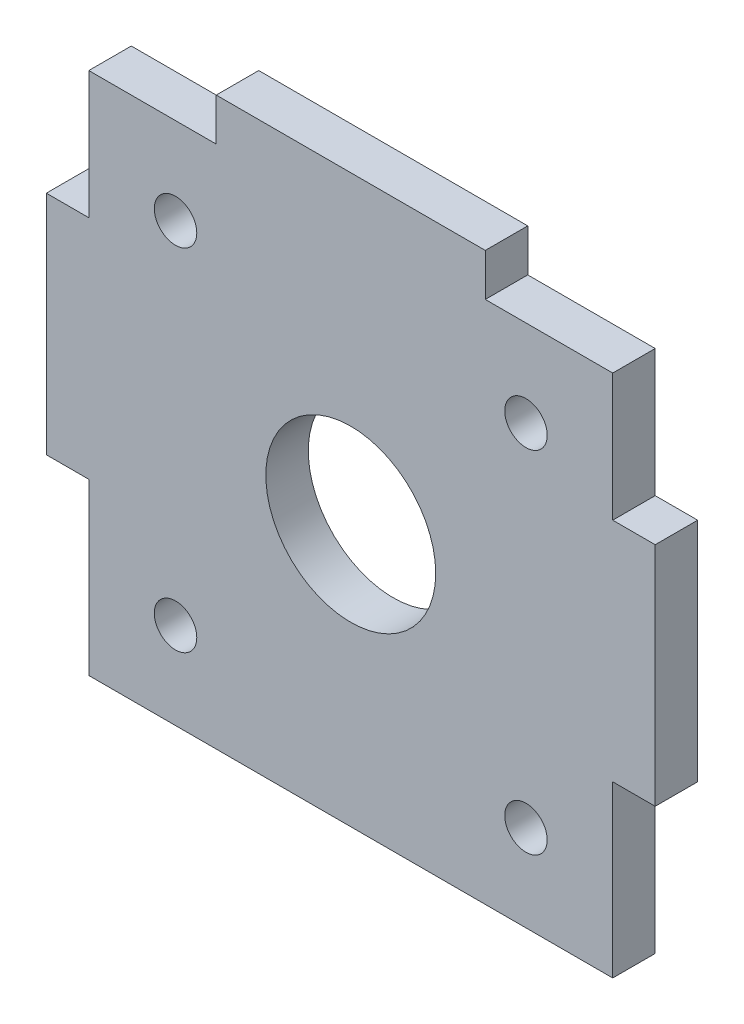
ISO-10303-21;
HEADER;
FILE_DESCRIPTION(('STEP AP214'),'2;1');
FILE_NAME('part.step','',(''),(''),'','','');
FILE_SCHEMA(('AUTOMOTIVE_DESIGN { 1 0 10303 214 1 1 1 1 }'));
ENDSEC;
DATA;
#1=APPLICATION_CONTEXT('core data for automotive mechanical design processes');
#2=APPLICATION_PROTOCOL_DEFINITION('international standard','automotive_design',2000,#1);
#3=PRODUCT_CONTEXT('',#1,'mechanical');
#4=PRODUCT('Part','Part','',(#3));
#5=PRODUCT_RELATED_PRODUCT_CATEGORY('part','',(#4));
#6=PRODUCT_DEFINITION_FORMATION('','',#4);
#7=PRODUCT_DEFINITION_CONTEXT('part definition',#1,'design');
#8=PRODUCT_DEFINITION('design','',#6,#7);
#9=PRODUCT_DEFINITION_SHAPE('','',#8);
#10=(LENGTH_UNIT() NAMED_UNIT(*) SI_UNIT(.MILLI.,.METRE.));
#11=(NAMED_UNIT(*) PLANE_ANGLE_UNIT() SI_UNIT($,.RADIAN.));
#12=(NAMED_UNIT(*) SI_UNIT($,.STERADIAN.) SOLID_ANGLE_UNIT());
#13=UNCERTAINTY_MEASURE_WITH_UNIT(LENGTH_MEASURE(1.E-05),#10,'distance_accuracy_value','');
#14=(GEOMETRIC_REPRESENTATION_CONTEXT(3) GLOBAL_UNCERTAINTY_ASSIGNED_CONTEXT((#13)) GLOBAL_UNIT_ASSIGNED_CONTEXT((#10,
#11,#12)) REPRESENTATION_CONTEXT('',''));
#15=CARTESIAN_POINT('',(0.,0.,0.));
#16=DIRECTION('',(0.,0.,1.));
#17=DIRECTION('',(1.,0.,0.));
#18=AXIS2_PLACEMENT_3D('',#15,#16,#17);
#19=CARTESIAN_POINT('',(0.,0.,3.));
#20=DIRECTION('',(0.,0.,1.));
#21=DIRECTION('',(1.,0.,0.));
#22=AXIS2_PLACEMENT_3D('',#19,#20,#21);
#23=PLANE('',#22);
#24=DIRECTION('',(-1.,0.,0.));
#25=VECTOR('',#24,1.);
#26=CARTESIAN_POINT('',(-21.5,-6.5,3.));
#27=LINE('',#26,#25);
#28=CARTESIAN_POINT('',(-18.5,-6.5,3.));
#29=VERTEX_POINT('',#28);
#30=CARTESIAN_POINT('',(-21.5,-6.5,3.));
#31=VERTEX_POINT('',#30);
#32=EDGE_CURVE('E65',#29,#31,#27,.T.);
#33=ORIENTED_EDGE('',*,*,#32,.F.);
#34=DIRECTION('',(0.,1.,0.));
#35=VECTOR('',#34,1.);
#36=CARTESIAN_POINT('',(-18.5,-18.5,3.));
#37=LINE('',#36,#35);
#38=CARTESIAN_POINT('',(-18.5,-18.5,3.));
#39=VERTEX_POINT('',#38);
#40=EDGE_CURVE('E341',#39,#29,#37,.T.);
#41=ORIENTED_EDGE('',*,*,#40,.F.);
#42=DIRECTION('',(-1.,0.,0.));
#43=VECTOR('',#42,1.);
#44=CARTESIAN_POINT('',(-18.5,-18.5,3.));
#45=LINE('',#44,#43);
#46=CARTESIAN_POINT('',(18.5,-18.5,3.));
#47=VERTEX_POINT('',#46);
#48=EDGE_CURVE('E345',#47,#39,#45,.T.);
#49=ORIENTED_EDGE('',*,*,#48,.F.);
#50=DIRECTION('',(0.,-1.,0.));
#51=VECTOR('',#50,1.);
#52=CARTESIAN_POINT('',(18.5,-18.5,3.));
#53=LINE('',#52,#51);
#54=CARTESIAN_POINT('',(18.5,-6.5,3.));
#55=VERTEX_POINT('',#54);
#56=EDGE_CURVE('E349',#55,#47,#53,.T.);
#57=ORIENTED_EDGE('',*,*,#56,.F.);
#58=DIRECTION('',(-1.,0.,0.));
#59=VECTOR('',#58,1.);
#60=CARTESIAN_POINT('',(21.5,-6.5,3.));
#61=LINE('',#60,#59);
#62=CARTESIAN_POINT('',(21.5,-6.5,3.));
#63=VERTEX_POINT('',#62);
#64=EDGE_CURVE('E296',#63,#55,#61,.T.);
#65=ORIENTED_EDGE('',*,*,#64,.F.);
#66=DIRECTION('',(0.,1.,0.));
#67=VECTOR('',#66,1.);
#68=CARTESIAN_POINT('',(21.5,21.5,3.));
#69=LINE('',#68,#67);
#70=CARTESIAN_POINT('',(21.5,9.5,3.));
#71=VERTEX_POINT('',#70);
#72=EDGE_CURVE('E174',#63,#71,#69,.T.);
#73=ORIENTED_EDGE('',*,*,#72,.T.);
#74=DIRECTION('',(1.,0.,0.));
#75=VECTOR('',#74,1.);
#76=CARTESIAN_POINT('',(21.5,9.5,3.));
#77=LINE('',#76,#75);
#78=CARTESIAN_POINT('',(18.5,9.5,3.));
#79=VERTEX_POINT('',#78);
#80=EDGE_CURVE('E266',#79,#71,#77,.T.);
#81=ORIENTED_EDGE('',*,*,#80,.F.);
#82=DIRECTION('',(0.,-1.,0.));
#83=VECTOR('',#82,1.);
#84=CARTESIAN_POINT('',(18.5,9.5,3.));
#85=LINE('',#84,#83);
#86=CARTESIAN_POINT('',(18.5,18.5,3.));
#87=VERTEX_POINT('',#86);
#88=EDGE_CURVE('E254',#87,#79,#85,.T.);
#89=ORIENTED_EDGE('',*,*,#88,.F.);
#90=DIRECTION('',(1.,0.,0.));
#91=VECTOR('',#90,1.);
#92=CARTESIAN_POINT('',(18.5,18.5,3.));
#93=LINE('',#92,#91);
#94=CARTESIAN_POINT('',(9.49999999999999,18.5,3.));
#95=VERTEX_POINT('',#94);
#96=EDGE_CURVE('E258',#95,#87,#93,.T.);
#97=ORIENTED_EDGE('',*,*,#96,.F.);
#98=DIRECTION('',(0.,-1.,0.));
#99=VECTOR('',#98,1.);
#100=CARTESIAN_POINT('',(9.49999999999999,18.5,3.));
#101=LINE('',#100,#99);
#102=CARTESIAN_POINT('',(9.49999999999999,21.5,3.));
#103=VERTEX_POINT('',#102);
#104=EDGE_CURVE('E262',#103,#95,#101,.T.);
#105=ORIENTED_EDGE('',*,*,#104,.F.);
#106=DIRECTION('',(-1.,0.,0.));
#107=VECTOR('',#106,1.);
#108=CARTESIAN_POINT('',(-21.5,21.5,3.));
#109=LINE('',#108,#107);
#110=CARTESIAN_POINT('',(-9.5,21.5,3.));
#111=VERTEX_POINT('',#110);
#112=EDGE_CURVE('E49',#103,#111,#109,.T.);
#113=ORIENTED_EDGE('',*,*,#112,.T.);
#114=DIRECTION('',(0.,1.,0.));
#115=VECTOR('',#114,1.);
#116=CARTESIAN_POINT('',(-9.5,18.5,3.));
#117=LINE('',#116,#115);
#118=CARTESIAN_POINT('',(-9.5,18.5,3.));
#119=VERTEX_POINT('',#118);
#120=EDGE_CURVE('E297',#119,#111,#117,.T.);
#121=ORIENTED_EDGE('',*,*,#120,.F.);
#122=DIRECTION('',(1.,0.,0.));
#123=VECTOR('',#122,1.);
#124=CARTESIAN_POINT('',(-18.5,18.5,3.));
#125=LINE('',#124,#123);
#126=CARTESIAN_POINT('',(-18.5,18.5,3.));
#127=VERTEX_POINT('',#126);
#128=EDGE_CURVE('E301',#127,#119,#125,.T.);
#129=ORIENTED_EDGE('',*,*,#128,.F.);
#130=DIRECTION('',(0.,1.,0.));
#131=VECTOR('',#130,1.);
#132=CARTESIAN_POINT('',(-18.5,9.49999999999999,3.));
#133=LINE('',#132,#131);
#134=CARTESIAN_POINT('',(-18.5,9.49999999999999,3.));
#135=VERTEX_POINT('',#134);
#136=EDGE_CURVE('E305',#135,#127,#133,.T.);
#137=ORIENTED_EDGE('',*,*,#136,.F.);
#138=DIRECTION('',(1.,0.,0.));
#139=VECTOR('',#138,1.);
#140=CARTESIAN_POINT('',(-21.5,9.49999999999999,3.));
#141=LINE('',#140,#139);
#142=CARTESIAN_POINT('',(-21.5,9.49999999999999,3.));
#143=VERTEX_POINT('',#142);
#144=EDGE_CURVE('E253',#143,#135,#141,.T.);
#145=ORIENTED_EDGE('',*,*,#144,.F.);
#146=DIRECTION('',(0.,-1.,0.));
#147=VECTOR('',#146,1.);
#148=CARTESIAN_POINT('',(-21.5,21.5,3.));
#149=LINE('',#148,#147);
#150=EDGE_CURVE('E11',#143,#31,#149,.T.);
#151=ORIENTED_EDGE('',*,*,#150,.T.);
#152=EDGE_LOOP('',(#33,#41,#49,#57,#65,#73,#81,#89,#97,#105,#113,#121,#129,#137,#145,#151));
#153=FACE_BOUND('',#152,.T.);
#154=CARTESIAN_POINT('',(-12.3743686707647,-12.3743686707645,3.));
#155=DIRECTION('',(0.,0.,1.));
#156=DIRECTION('',(1.,0.,0.));
#157=AXIS2_PLACEMENT_3D('',#154,#155,#156);
#158=CIRCLE('',#157,1.5);
#159=CARTESIAN_POINT('',(-10.8743686707647,-12.3743686707645,3.));
#160=VERTEX_POINT('',#159);
#161=EDGE_CURVE('E217',#160,#160,#158,.T.);
#162=ORIENTED_EDGE('',*,*,#161,.F.);
#163=EDGE_LOOP('',(#162));
#164=FACE_BOUND('',#163,.T.);
#165=CARTESIAN_POINT('',(12.3743686707645,-12.3743686707646,3.));
#166=DIRECTION('',(0.,0.,1.));
#167=DIRECTION('',(1.,0.,0.));
#168=AXIS2_PLACEMENT_3D('',#165,#166,#167);
#169=CIRCLE('',#168,1.5);
#170=CARTESIAN_POINT('',(13.8743686707645,-12.3743686707646,3.));
#171=VERTEX_POINT('',#170);
#172=EDGE_CURVE('E203',#171,#171,#169,.T.);
#173=ORIENTED_EDGE('',*,*,#172,.F.);
#174=EDGE_LOOP('',(#173));
#175=FACE_BOUND('',#174,.T.);
#176=CARTESIAN_POINT('',(-12.3743686707645,12.3743686707647,3.));
#177=DIRECTION('',(0.,0.,1.));
#178=DIRECTION('',(1.,0.,0.));
#179=AXIS2_PLACEMENT_3D('',#176,#177,#178);
#180=CIRCLE('',#179,1.5);
#181=CARTESIAN_POINT('',(-10.8743686707645,12.3743686707647,3.));
#182=VERTEX_POINT('',#181);
#183=EDGE_CURVE('E187',#182,#182,#180,.T.);
#184=ORIENTED_EDGE('',*,*,#183,.F.);
#185=EDGE_LOOP('',(#184));
#186=FACE_BOUND('',#185,.T.);
#187=CARTESIAN_POINT('',(12.3743686707646,12.3743686707645,3.));
#188=DIRECTION('',(0.,0.,1.));
#189=DIRECTION('',(1.,0.,0.));
#190=AXIS2_PLACEMENT_3D('',#187,#188,#189);
#191=CIRCLE('',#190,1.5);
#192=CARTESIAN_POINT('',(13.8743686707646,12.3743686707645,3.));
#193=VERTEX_POINT('',#192);
#194=EDGE_CURVE('E209',#193,#193,#191,.T.);
#195=ORIENTED_EDGE('',*,*,#194,.F.);
#196=EDGE_LOOP('',(#195));
#197=FACE_BOUND('',#196,.T.);
#198=CARTESIAN_POINT('',(0.,0.,3.));
#199=DIRECTION('',(0.,0.,1.));
#200=DIRECTION('',(1.,0.,0.));
#201=AXIS2_PLACEMENT_3D('',#198,#199,#200);
#202=CIRCLE('',#201,6.);
#203=CARTESIAN_POINT('',(5.99999999999999,0.,3.));
#204=VERTEX_POINT('',#203);
#205=EDGE_CURVE('E225',#204,#204,#202,.T.);
#206=ORIENTED_EDGE('',*,*,#205,.F.);
#207=EDGE_LOOP('',(#206));
#208=FACE_BOUND('',#207,.T.);
#209=ADVANCED_FACE('F39',(#153,#164,#175,#186,#197,#208),#23,.T.);
#210=CARTESIAN_POINT('',(0.,0.,0.));
#211=DIRECTION('',(0.,0.,1.));
#212=DIRECTION('',(1.,0.,0.));
#213=AXIS2_PLACEMENT_3D('',#210,#211,#212);
#214=PLANE('',#213);
#215=DIRECTION('',(0.,1.,0.));
#216=VECTOR('',#215,1.);
#217=CARTESIAN_POINT('',(-18.5,-18.5,0.));
#218=LINE('',#217,#216);
#219=CARTESIAN_POINT('',(-18.5,-18.5,0.));
#220=VERTEX_POINT('',#219);
#221=CARTESIAN_POINT('',(-18.5,-6.5,0.));
#222=VERTEX_POINT('',#221);
#223=EDGE_CURVE('E358',#220,#222,#218,.T.);
#224=ORIENTED_EDGE('',*,*,#223,.T.);
#225=DIRECTION('',(-1.,0.,0.));
#226=VECTOR('',#225,1.);
#227=CARTESIAN_POINT('',(-21.5,-6.5,0.));
#228=LINE('',#227,#226);
#229=CARTESIAN_POINT('',(-21.5,-6.5,0.));
#230=VERTEX_POINT('',#229);
#231=EDGE_CURVE('E176',#222,#230,#228,.T.);
#232=ORIENTED_EDGE('',*,*,#231,.T.);
#233=DIRECTION('',(0.,-1.,0.));
#234=VECTOR('',#233,1.);
#235=CARTESIAN_POINT('',(-21.5,21.5,0.));
#236=LINE('',#235,#234);
#237=CARTESIAN_POINT('',(-21.5,9.49999999999999,0.));
#238=VERTEX_POINT('',#237);
#239=EDGE_CURVE('E43',#238,#230,#236,.T.);
#240=ORIENTED_EDGE('',*,*,#239,.F.);
#241=DIRECTION('',(1.,0.,0.));
#242=VECTOR('',#241,1.);
#243=CARTESIAN_POINT('',(-21.5,9.49999999999999,0.));
#244=LINE('',#243,#242);
#245=CARTESIAN_POINT('',(-18.5,9.49999999999999,0.));
#246=VERTEX_POINT('',#245);
#247=EDGE_CURVE('E300',#238,#246,#244,.T.);
#248=ORIENTED_EDGE('',*,*,#247,.T.);
#249=DIRECTION('',(0.,1.,0.));
#250=VECTOR('',#249,1.);
#251=CARTESIAN_POINT('',(-18.5,9.49999999999999,0.));
#252=LINE('',#251,#250);
#253=CARTESIAN_POINT('',(-18.5,18.5,0.));
#254=VERTEX_POINT('',#253);
#255=EDGE_CURVE('E319',#246,#254,#252,.T.);
#256=ORIENTED_EDGE('',*,*,#255,.T.);
#257=DIRECTION('',(1.,0.,0.));
#258=VECTOR('',#257,1.);
#259=CARTESIAN_POINT('',(-18.5,18.5,0.));
#260=LINE('',#259,#258);
#261=CARTESIAN_POINT('',(-9.5,18.5,0.));
#262=VERTEX_POINT('',#261);
#263=EDGE_CURVE('E315',#254,#262,#260,.T.);
#264=ORIENTED_EDGE('',*,*,#263,.T.);
#265=DIRECTION('',(0.,1.,0.));
#266=VECTOR('',#265,1.);
#267=CARTESIAN_POINT('',(-9.5,18.5,0.));
#268=LINE('',#267,#266);
#269=CARTESIAN_POINT('',(-9.5,21.5,0.));
#270=VERTEX_POINT('',#269);
#271=EDGE_CURVE('E283',#262,#270,#268,.T.);
#272=ORIENTED_EDGE('',*,*,#271,.T.);
#273=DIRECTION('',(-1.,0.,0.));
#274=VECTOR('',#273,1.);
#275=CARTESIAN_POINT('',(-21.5,21.5,0.));
#276=LINE('',#275,#274);
#277=CARTESIAN_POINT('',(9.49999999999999,21.5,0.));
#278=VERTEX_POINT('',#277);
#279=EDGE_CURVE('E186',#278,#270,#276,.T.);
#280=ORIENTED_EDGE('',*,*,#279,.F.);
#281=DIRECTION('',(0.,-1.,0.));
#282=VECTOR('',#281,1.);
#283=CARTESIAN_POINT('',(9.49999999999999,18.5,0.));
#284=LINE('',#283,#282);
#285=CARTESIAN_POINT('',(9.49999999999999,18.5,0.));
#286=VERTEX_POINT('',#285);
#287=EDGE_CURVE('E57',#278,#286,#284,.T.);
#288=ORIENTED_EDGE('',*,*,#287,.T.);
#289=DIRECTION('',(1.,0.,0.));
#290=VECTOR('',#289,1.);
#291=CARTESIAN_POINT('',(18.5,18.5,0.));
#292=LINE('',#291,#290);
#293=CARTESIAN_POINT('',(18.5,18.5,0.));
#294=VERTEX_POINT('',#293);
#295=EDGE_CURVE('E271',#286,#294,#292,.T.);
#296=ORIENTED_EDGE('',*,*,#295,.T.);
#297=DIRECTION('',(0.,-1.,0.));
#298=VECTOR('',#297,1.);
#299=CARTESIAN_POINT('',(18.5,9.5,0.));
#300=LINE('',#299,#298);
#301=CARTESIAN_POINT('',(18.5,9.5,0.));
#302=VERTEX_POINT('',#301);
#303=EDGE_CURVE('E241',#294,#302,#300,.T.);
#304=ORIENTED_EDGE('',*,*,#303,.T.);
#305=DIRECTION('',(1.,0.,0.));
#306=VECTOR('',#305,1.);
#307=CARTESIAN_POINT('',(21.5,9.5,0.));
#308=LINE('',#307,#306);
#309=CARTESIAN_POINT('',(21.5,9.5,0.));
#310=VERTEX_POINT('',#309);
#311=EDGE_CURVE('E184',#302,#310,#308,.T.);
#312=ORIENTED_EDGE('',*,*,#311,.T.);
#313=DIRECTION('',(0.,1.,0.));
#314=VECTOR('',#313,1.);
#315=CARTESIAN_POINT('',(21.5,21.5,0.));
#316=LINE('',#315,#314);
#317=CARTESIAN_POINT('',(21.5,-6.5,0.));
#318=VERTEX_POINT('',#317);
#319=EDGE_CURVE('E172',#318,#310,#316,.T.);
#320=ORIENTED_EDGE('',*,*,#319,.F.);
#321=DIRECTION('',(-1.,0.,0.));
#322=VECTOR('',#321,1.);
#323=CARTESIAN_POINT('',(21.5,-6.5,0.));
#324=LINE('',#323,#322);
#325=CARTESIAN_POINT('',(18.5,-6.5,0.));
#326=VERTEX_POINT('',#325);
#327=EDGE_CURVE('E154',#318,#326,#324,.T.);
#328=ORIENTED_EDGE('',*,*,#327,.T.);
#329=DIRECTION('',(0.,-1.,0.));
#330=VECTOR('',#329,1.);
#331=CARTESIAN_POINT('',(18.5,-18.5,0.));
#332=LINE('',#331,#330);
#333=CARTESIAN_POINT('',(18.5,-18.5,0.));
#334=VERTEX_POINT('',#333);
#335=EDGE_CURVE('E166',#326,#334,#332,.T.);
#336=ORIENTED_EDGE('',*,*,#335,.T.);
#337=DIRECTION('',(-1.,0.,0.));
#338=VECTOR('',#337,1.);
#339=CARTESIAN_POINT('',(-18.5,-18.5,0.));
#340=LINE('',#339,#338);
#341=EDGE_CURVE('E361',#334,#220,#340,.T.);
#342=ORIENTED_EDGE('',*,*,#341,.T.);
#343=EDGE_LOOP('',(#224,#232,#240,#248,#256,#264,#272,#280,#288,#296,#304,#312,#320,#328,#336,#342));
#344=FACE_BOUND('',#343,.T.);
#345=CARTESIAN_POINT('',(-12.3743686707645,12.3743686707647,0.));
#346=DIRECTION('',(0.,0.,1.));
#347=DIRECTION('',(1.,0.,0.));
#348=AXIS2_PLACEMENT_3D('',#345,#346,#347);
#349=CIRCLE('',#348,1.5);
#350=CARTESIAN_POINT('',(-10.8743686707645,12.3743686707647,0.));
#351=VERTEX_POINT('',#350);
#352=EDGE_CURVE('E193',#351,#351,#349,.T.);
#353=ORIENTED_EDGE('',*,*,#352,.T.);
#354=EDGE_LOOP('',(#353));
#355=FACE_BOUND('',#354,.T.);
#356=CARTESIAN_POINT('',(12.3743686707645,-12.3743686707646,0.));
#357=DIRECTION('',(0.,0.,1.));
#358=DIRECTION('',(1.,0.,0.));
#359=AXIS2_PLACEMENT_3D('',#356,#357,#358);
#360=CIRCLE('',#359,1.5);
#361=CARTESIAN_POINT('',(13.8743686707645,-12.3743686707646,0.));
#362=VERTEX_POINT('',#361);
#363=EDGE_CURVE('E205',#362,#362,#360,.T.);
#364=ORIENTED_EDGE('',*,*,#363,.T.);
#365=EDGE_LOOP('',(#364));
#366=FACE_BOUND('',#365,.T.);
#367=CARTESIAN_POINT('',(12.3743686707646,12.3743686707645,0.));
#368=DIRECTION('',(0.,0.,1.));
#369=DIRECTION('',(1.,0.,0.));
#370=AXIS2_PLACEMENT_3D('',#367,#368,#369);
#371=CIRCLE('',#370,1.5);
#372=CARTESIAN_POINT('',(13.8743686707646,12.3743686707645,0.));
#373=VERTEX_POINT('',#372);
#374=EDGE_CURVE('E213',#373,#373,#371,.T.);
#375=ORIENTED_EDGE('',*,*,#374,.T.);
#376=EDGE_LOOP('',(#375));
#377=FACE_BOUND('',#376,.T.);
#378=CARTESIAN_POINT('',(-12.3743686707647,-12.3743686707645,0.));
#379=DIRECTION('',(0.,0.,1.));
#380=DIRECTION('',(1.,0.,0.));
#381=AXIS2_PLACEMENT_3D('',#378,#379,#380);
#382=CIRCLE('',#381,1.5);
#383=CARTESIAN_POINT('',(-10.8743686707647,-12.3743686707645,0.));
#384=VERTEX_POINT('',#383);
#385=EDGE_CURVE('E221',#384,#384,#382,.T.);
#386=ORIENTED_EDGE('',*,*,#385,.T.);
#387=EDGE_LOOP('',(#386));
#388=FACE_BOUND('',#387,.T.);
#389=CARTESIAN_POINT('',(0.,0.,0.));
#390=DIRECTION('',(0.,0.,1.));
#391=DIRECTION('',(1.,0.,0.));
#392=AXIS2_PLACEMENT_3D('',#389,#390,#391);
#393=CIRCLE('',#392,6.);
#394=CARTESIAN_POINT('',(5.99999999999999,0.,0.));
#395=VERTEX_POINT('',#394);
#396=EDGE_CURVE('E229',#395,#395,#393,.T.);
#397=ORIENTED_EDGE('',*,*,#396,.T.);
#398=EDGE_LOOP('',(#397));
#399=FACE_BOUND('',#398,.T.);
#400=ADVANCED_FACE('F180',(#344,#355,#366,#377,#388,#399),#214,.F.);
#401=CARTESIAN_POINT('',(21.5,21.5,3.));
#402=DIRECTION('',(-1.,0.,0.));
#403=DIRECTION('',(0.,-1.,0.));
#404=AXIS2_PLACEMENT_3D('',#401,#402,#403);
#405=PLANE('',#404);
#406=ORIENTED_EDGE('',*,*,#72,.F.);
#407=DIRECTION('',(0.,0.,1.));
#408=VECTOR('',#407,1.);
#409=CARTESIAN_POINT('',(21.5,-6.5,0.));
#410=LINE('',#409,#408);
#411=EDGE_CURVE('E158',#318,#63,#410,.T.);
#412=ORIENTED_EDGE('',*,*,#411,.F.);
#413=ORIENTED_EDGE('',*,*,#319,.T.);
#414=DIRECTION('',(0.,0.,1.));
#415=VECTOR('',#414,1.);
#416=CARTESIAN_POINT('',(21.5,9.5,0.));
#417=LINE('',#416,#415);
#418=EDGE_CURVE('E237',#310,#71,#417,.T.);
#419=ORIENTED_EDGE('',*,*,#418,.T.);
#420=EDGE_LOOP('',(#406,#412,#413,#419));
#421=FACE_BOUND('',#420,.T.);
#422=ADVANCED_FACE('F41',(#421),#405,.F.);
#423=CARTESIAN_POINT('',(-21.5,21.5,3.));
#424=DIRECTION('',(0.,-1.,0.));
#425=DIRECTION('',(1.,0.,0.));
#426=AXIS2_PLACEMENT_3D('',#423,#424,#425);
#427=PLANE('',#426);
#428=ORIENTED_EDGE('',*,*,#279,.T.);
#429=DIRECTION('',(0.,0.,1.));
#430=VECTOR('',#429,1.);
#431=CARTESIAN_POINT('',(-9.5,21.5,0.));
#432=LINE('',#431,#430);
#433=EDGE_CURVE('E292',#270,#111,#432,.T.);
#434=ORIENTED_EDGE('',*,*,#433,.T.);
#435=ORIENTED_EDGE('',*,*,#112,.F.);
#436=DIRECTION('',(0.,0.,1.));
#437=VECTOR('',#436,1.);
#438=CARTESIAN_POINT('',(9.49999999999999,21.5,0.));
#439=LINE('',#438,#437);
#440=EDGE_CURVE('E240',#278,#103,#439,.T.);
#441=ORIENTED_EDGE('',*,*,#440,.F.);
#442=EDGE_LOOP('',(#428,#434,#435,#441));
#443=FACE_BOUND('',#442,.T.);
#444=ADVANCED_FACE('F405',(#443),#427,.F.);
#445=CARTESIAN_POINT('',(-21.5,21.5,3.));
#446=DIRECTION('',(1.,0.,0.));
#447=DIRECTION('',(0.,1.,0.));
#448=AXIS2_PLACEMENT_3D('',#445,#446,#447);
#449=PLANE('',#448);
#450=ORIENTED_EDGE('',*,*,#239,.T.);
#451=DIRECTION('',(0.,0.,1.));
#452=VECTOR('',#451,1.);
#453=CARTESIAN_POINT('',(-21.5,-6.5,0.));
#454=LINE('',#453,#452);
#455=EDGE_CURVE('E233',#230,#31,#454,.T.);
#456=ORIENTED_EDGE('',*,*,#455,.T.);
#457=ORIENTED_EDGE('',*,*,#150,.F.);
#458=DIRECTION('',(0.,0.,1.));
#459=VECTOR('',#458,1.);
#460=CARTESIAN_POINT('',(-21.5,9.49999999999999,0.));
#461=LINE('',#460,#459);
#462=EDGE_CURVE('E279',#238,#143,#461,.T.);
#463=ORIENTED_EDGE('',*,*,#462,.F.);
#464=EDGE_LOOP('',(#450,#456,#457,#463));
#465=FACE_BOUND('',#464,.T.);
#466=ADVANCED_FACE('F382',(#465),#449,.F.);
#467=CARTESIAN_POINT('',(-12.3743686707645,12.3743686707647,3.));
#468=DIRECTION('',(0.,0.,-1.));
#469=DIRECTION('',(-1.,0.,0.));
#470=AXIS2_PLACEMENT_3D('',#467,#468,#469);
#471=CYLINDRICAL_SURFACE('',#470,1.5);
#472=ORIENTED_EDGE('',*,*,#183,.T.);
#473=EDGE_LOOP('',(#472));
#474=FACE_BOUND('',#473,.T.);
#475=ORIENTED_EDGE('',*,*,#352,.F.);
#476=EDGE_LOOP('',(#475));
#477=FACE_BOUND('',#476,.T.);
#478=ADVANCED_FACE('F436',(#474,#477),#471,.F.);
#479=CARTESIAN_POINT('',(12.3743686707645,-12.3743686707646,3.));
#480=DIRECTION('',(0.,0.,-1.));
#481=DIRECTION('',(-1.,0.,0.));
#482=AXIS2_PLACEMENT_3D('',#479,#480,#481);
#483=CYLINDRICAL_SURFACE('',#482,1.5);
#484=ORIENTED_EDGE('',*,*,#172,.T.);
#485=EDGE_LOOP('',(#484));
#486=FACE_BOUND('',#485,.T.);
#487=ORIENTED_EDGE('',*,*,#363,.F.);
#488=EDGE_LOOP('',(#487));
#489=FACE_BOUND('',#488,.T.);
#490=ADVANCED_FACE('F485',(#486,#489),#483,.F.);
#491=CARTESIAN_POINT('',(12.3743686707646,12.3743686707645,3.));
#492=DIRECTION('',(0.,0.,-1.));
#493=DIRECTION('',(-1.,0.,0.));
#494=AXIS2_PLACEMENT_3D('',#491,#492,#493);
#495=CYLINDRICAL_SURFACE('',#494,1.5);
#496=ORIENTED_EDGE('',*,*,#194,.T.);
#497=EDGE_LOOP('',(#496));
#498=FACE_BOUND('',#497,.T.);
#499=ORIENTED_EDGE('',*,*,#374,.F.);
#500=EDGE_LOOP('',(#499));
#501=FACE_BOUND('',#500,.T.);
#502=ADVANCED_FACE('F475',(#498,#501),#495,.F.);
#503=CARTESIAN_POINT('',(-12.3743686707647,-12.3743686707645,3.));
#504=DIRECTION('',(0.,0.,-1.));
#505=DIRECTION('',(-1.,0.,0.));
#506=AXIS2_PLACEMENT_3D('',#503,#504,#505);
#507=CYLINDRICAL_SURFACE('',#506,1.5);
#508=ORIENTED_EDGE('',*,*,#161,.T.);
#509=EDGE_LOOP('',(#508));
#510=FACE_BOUND('',#509,.T.);
#511=ORIENTED_EDGE('',*,*,#385,.F.);
#512=EDGE_LOOP('',(#511));
#513=FACE_BOUND('',#512,.T.);
#514=ADVANCED_FACE('F464',(#510,#513),#507,.F.);
#515=CARTESIAN_POINT('',(0.,0.,3.));
#516=DIRECTION('',(0.,0.,-1.));
#517=DIRECTION('',(-1.,0.,0.));
#518=AXIS2_PLACEMENT_3D('',#515,#516,#517);
#519=CYLINDRICAL_SURFACE('',#518,6.);
#520=ORIENTED_EDGE('',*,*,#205,.T.);
#521=EDGE_LOOP('',(#520));
#522=FACE_BOUND('',#521,.T.);
#523=ORIENTED_EDGE('',*,*,#396,.F.);
#524=EDGE_LOOP('',(#523));
#525=FACE_BOUND('',#524,.T.);
#526=ADVANCED_FACE('F459',(#522,#525),#519,.F.);
#527=CARTESIAN_POINT('',(-9.5,18.5,0.));
#528=DIRECTION('',(1.,0.,0.));
#529=DIRECTION('',(0.,0.,-1.));
#530=AXIS2_PLACEMENT_3D('',#527,#528,#529);
#531=PLANE('',#530);
#532=ORIENTED_EDGE('',*,*,#120,.T.);
#533=ORIENTED_EDGE('',*,*,#433,.F.);
#534=ORIENTED_EDGE('',*,*,#271,.F.);
#535=DIRECTION('',(0.,0.,1.));
#536=VECTOR('',#535,1.);
#537=CARTESIAN_POINT('',(-9.5,18.5,0.));
#538=LINE('',#537,#536);
#539=EDGE_CURVE('E289',#262,#119,#538,.T.);
#540=ORIENTED_EDGE('',*,*,#539,.T.);
#541=EDGE_LOOP('',(#532,#533,#534,#540));
#542=FACE_BOUND('',#541,.T.);
#543=ADVANCED_FACE('F402',(#542),#531,.F.);
#544=CARTESIAN_POINT('',(-18.5,18.5,0.));
#545=DIRECTION('',(0.,-1.,0.));
#546=DIRECTION('',(0.,0.,-1.));
#547=AXIS2_PLACEMENT_3D('',#544,#545,#546);
#548=PLANE('',#547);
#549=ORIENTED_EDGE('',*,*,#128,.T.);
#550=ORIENTED_EDGE('',*,*,#539,.F.);
#551=ORIENTED_EDGE('',*,*,#263,.F.);
#552=DIRECTION('',(0.,0.,1.));
#553=VECTOR('',#552,1.);
#554=CARTESIAN_POINT('',(-18.5,18.5,0.));
#555=LINE('',#554,#553);
#556=EDGE_CURVE('E286',#254,#127,#555,.T.);
#557=ORIENTED_EDGE('',*,*,#556,.T.);
#558=EDGE_LOOP('',(#549,#550,#551,#557));
#559=FACE_BOUND('',#558,.T.);
#560=ADVANCED_FACE('F400',(#559),#548,.F.);
#561=CARTESIAN_POINT('',(-18.5,9.49999999999999,0.));
#562=DIRECTION('',(1.,0.,0.));
#563=DIRECTION('',(0.,0.,-1.));
#564=AXIS2_PLACEMENT_3D('',#561,#562,#563);
#565=PLANE('',#564);
#566=ORIENTED_EDGE('',*,*,#136,.T.);
#567=ORIENTED_EDGE('',*,*,#556,.F.);
#568=ORIENTED_EDGE('',*,*,#255,.F.);
#569=DIRECTION('',(0.,0.,1.));
#570=VECTOR('',#569,1.);
#571=CARTESIAN_POINT('',(-18.5,9.49999999999999,0.));
#572=LINE('',#571,#570);
#573=EDGE_CURVE('E282',#246,#135,#572,.T.);
#574=ORIENTED_EDGE('',*,*,#573,.T.);
#575=EDGE_LOOP('',(#566,#567,#568,#574));
#576=FACE_BOUND('',#575,.T.);
#577=ADVANCED_FACE('F394',(#576),#565,.F.);
#578=CARTESIAN_POINT('',(-21.5,9.49999999999999,0.));
#579=DIRECTION('',(0.,-1.,0.));
#580=DIRECTION('',(0.,0.,-1.));
#581=AXIS2_PLACEMENT_3D('',#578,#579,#580);
#582=PLANE('',#581);
#583=ORIENTED_EDGE('',*,*,#144,.T.);
#584=ORIENTED_EDGE('',*,*,#573,.F.);
#585=ORIENTED_EDGE('',*,*,#247,.F.);
#586=ORIENTED_EDGE('',*,*,#462,.T.);
#587=EDGE_LOOP('',(#583,#584,#585,#586));
#588=FACE_BOUND('',#587,.T.);
#589=ADVANCED_FACE('F387',(#588),#582,.F.);
#590=CARTESIAN_POINT('',(-21.5,-6.5,0.));
#591=DIRECTION('',(0.,1.,0.));
#592=DIRECTION('',(0.,0.,1.));
#593=AXIS2_PLACEMENT_3D('',#590,#591,#592);
#594=PLANE('',#593);
#595=ORIENTED_EDGE('',*,*,#32,.T.);
#596=ORIENTED_EDGE('',*,*,#455,.F.);
#597=ORIENTED_EDGE('',*,*,#231,.F.);
#598=DIRECTION('',(0.,0.,1.));
#599=VECTOR('',#598,1.);
#600=CARTESIAN_POINT('',(-18.5,-6.5,0.));
#601=LINE('',#600,#599);
#602=EDGE_CURVE('E334',#222,#29,#601,.T.);
#603=ORIENTED_EDGE('',*,*,#602,.T.);
#604=EDGE_LOOP('',(#595,#596,#597,#603));
#605=FACE_BOUND('',#604,.T.);
#606=ADVANCED_FACE('F541',(#605),#594,.F.);
#607=CARTESIAN_POINT('',(-18.5,-18.5,0.));
#608=DIRECTION('',(1.,0.,0.));
#609=DIRECTION('',(0.,0.,-1.));
#610=AXIS2_PLACEMENT_3D('',#607,#608,#609);
#611=PLANE('',#610);
#612=ORIENTED_EDGE('',*,*,#40,.T.);
#613=ORIENTED_EDGE('',*,*,#602,.F.);
#614=ORIENTED_EDGE('',*,*,#223,.F.);
#615=DIRECTION('',(0.,0.,1.));
#616=VECTOR('',#615,1.);
#617=CARTESIAN_POINT('',(-18.5,-18.5,0.));
#618=LINE('',#617,#616);
#619=EDGE_CURVE('E331',#220,#39,#618,.T.);
#620=ORIENTED_EDGE('',*,*,#619,.T.);
#621=EDGE_LOOP('',(#612,#613,#614,#620));
#622=FACE_BOUND('',#621,.T.);
#623=ADVANCED_FACE('F376',(#622),#611,.F.);
#624=CARTESIAN_POINT('',(-18.5,-18.5,0.));
#625=DIRECTION('',(0.,1.,0.));
#626=DIRECTION('',(0.,0.,1.));
#627=AXIS2_PLACEMENT_3D('',#624,#625,#626);
#628=PLANE('',#627);
#629=ORIENTED_EDGE('',*,*,#48,.T.);
#630=ORIENTED_EDGE('',*,*,#619,.F.);
#631=ORIENTED_EDGE('',*,*,#341,.F.);
#632=DIRECTION('',(0.,0.,1.));
#633=VECTOR('',#632,1.);
#634=CARTESIAN_POINT('',(18.5,-18.5,0.));
#635=LINE('',#634,#633);
#636=EDGE_CURVE('E328',#334,#47,#635,.T.);
#637=ORIENTED_EDGE('',*,*,#636,.T.);
#638=EDGE_LOOP('',(#629,#630,#631,#637));
#639=FACE_BOUND('',#638,.T.);
#640=ADVANCED_FACE('F372',(#639),#628,.F.);
#641=CARTESIAN_POINT('',(18.5,-18.5,0.));
#642=DIRECTION('',(-1.,0.,0.));
#643=DIRECTION('',(0.,-1.,0.));
#644=AXIS2_PLACEMENT_3D('',#641,#642,#643);
#645=PLANE('',#644);
#646=ORIENTED_EDGE('',*,*,#56,.T.);
#647=ORIENTED_EDGE('',*,*,#636,.F.);
#648=ORIENTED_EDGE('',*,*,#335,.F.);
#649=DIRECTION('',(0.,0.,1.));
#650=VECTOR('',#649,1.);
#651=CARTESIAN_POINT('',(18.5,-6.5,0.));
#652=LINE('',#651,#650);
#653=EDGE_CURVE('E160',#326,#55,#652,.T.);
#654=ORIENTED_EDGE('',*,*,#653,.T.);
#655=EDGE_LOOP('',(#646,#647,#648,#654));
#656=FACE_BOUND('',#655,.T.);
#657=ADVANCED_FACE('F368',(#656),#645,.F.);
#658=CARTESIAN_POINT('',(21.5,-6.5,0.));
#659=DIRECTION('',(0.,1.,0.));
#660=DIRECTION('',(-1.,0.,0.));
#661=AXIS2_PLACEMENT_3D('',#658,#659,#660);
#662=PLANE('',#661);
#663=ORIENTED_EDGE('',*,*,#64,.T.);
#664=ORIENTED_EDGE('',*,*,#653,.F.);
#665=ORIENTED_EDGE('',*,*,#327,.F.);
#666=ORIENTED_EDGE('',*,*,#411,.T.);
#667=EDGE_LOOP('',(#663,#664,#665,#666));
#668=FACE_BOUND('',#667,.T.);
#669=ADVANCED_FACE('F157',(#668),#662,.F.);
#670=CARTESIAN_POINT('',(21.5,9.5,0.));
#671=DIRECTION('',(0.,-1.,0.));
#672=DIRECTION('',(0.,0.,-1.));
#673=AXIS2_PLACEMENT_3D('',#670,#671,#672);
#674=PLANE('',#673);
#675=ORIENTED_EDGE('',*,*,#80,.T.);
#676=ORIENTED_EDGE('',*,*,#418,.F.);
#677=ORIENTED_EDGE('',*,*,#311,.F.);
#678=DIRECTION('',(0.,0.,1.));
#679=VECTOR('',#678,1.);
#680=CARTESIAN_POINT('',(18.5,9.5,0.));
#681=LINE('',#680,#679);
#682=EDGE_CURVE('E250',#302,#79,#681,.T.);
#683=ORIENTED_EDGE('',*,*,#682,.T.);
#684=EDGE_LOOP('',(#675,#676,#677,#683));
#685=FACE_BOUND('',#684,.T.);
#686=ADVANCED_FACE('F418',(#685),#674,.F.);
#687=CARTESIAN_POINT('',(18.5,9.5,0.));
#688=DIRECTION('',(-1.,0.,0.));
#689=DIRECTION('',(0.,-1.,0.));
#690=AXIS2_PLACEMENT_3D('',#687,#688,#689);
#691=PLANE('',#690);
#692=ORIENTED_EDGE('',*,*,#88,.T.);
#693=ORIENTED_EDGE('',*,*,#682,.F.);
#694=ORIENTED_EDGE('',*,*,#303,.F.);
#695=DIRECTION('',(0.,0.,1.));
#696=VECTOR('',#695,1.);
#697=CARTESIAN_POINT('',(18.5,18.5,0.));
#698=LINE('',#697,#696);
#699=EDGE_CURVE('E247',#294,#87,#698,.T.);
#700=ORIENTED_EDGE('',*,*,#699,.T.);
#701=EDGE_LOOP('',(#692,#693,#694,#700));
#702=FACE_BOUND('',#701,.T.);
#703=ADVANCED_FACE('F415',(#702),#691,.F.);
#704=CARTESIAN_POINT('',(18.5,18.5,0.));
#705=DIRECTION('',(0.,-1.,0.));
#706=DIRECTION('',(0.,0.,-1.));
#707=AXIS2_PLACEMENT_3D('',#704,#705,#706);
#708=PLANE('',#707);
#709=ORIENTED_EDGE('',*,*,#96,.T.);
#710=ORIENTED_EDGE('',*,*,#699,.F.);
#711=ORIENTED_EDGE('',*,*,#295,.F.);
#712=DIRECTION('',(0.,0.,1.));
#713=VECTOR('',#712,1.);
#714=CARTESIAN_POINT('',(9.49999999999999,18.5,0.));
#715=LINE('',#714,#713);
#716=EDGE_CURVE('E244',#286,#95,#715,.T.);
#717=ORIENTED_EDGE('',*,*,#716,.T.);
#718=EDGE_LOOP('',(#709,#710,#711,#717));
#719=FACE_BOUND('',#718,.T.);
#720=ADVANCED_FACE('F413',(#719),#708,.F.);
#721=CARTESIAN_POINT('',(9.49999999999999,18.5,0.));
#722=DIRECTION('',(-1.,0.,0.));
#723=DIRECTION('',(0.,-1.,0.));
#724=AXIS2_PLACEMENT_3D('',#721,#722,#723);
#725=PLANE('',#724);
#726=ORIENTED_EDGE('',*,*,#104,.T.);
#727=ORIENTED_EDGE('',*,*,#716,.F.);
#728=ORIENTED_EDGE('',*,*,#287,.F.);
#729=ORIENTED_EDGE('',*,*,#440,.T.);
#730=EDGE_LOOP('',(#726,#727,#728,#729));
#731=FACE_BOUND('',#730,.T.);
#732=ADVANCED_FACE('F409',(#731),#725,.F.);
#733=CLOSED_SHELL('',(#209,#400,#422,#444,#466,#478,#490,#502,#514,#526,#543,#560,#577,#589,
#606,#623,#640,#657,#669,#686,#703,#720,#732));
#734=MANIFOLD_SOLID_BREP('B2',#733);
#735=ADVANCED_BREP_SHAPE_REPRESENTATION('',(#18,#734),#14);
#736=SHAPE_DEFINITION_REPRESENTATION(#9,#735);
ENDSEC;
END-ISO-10303-21;
